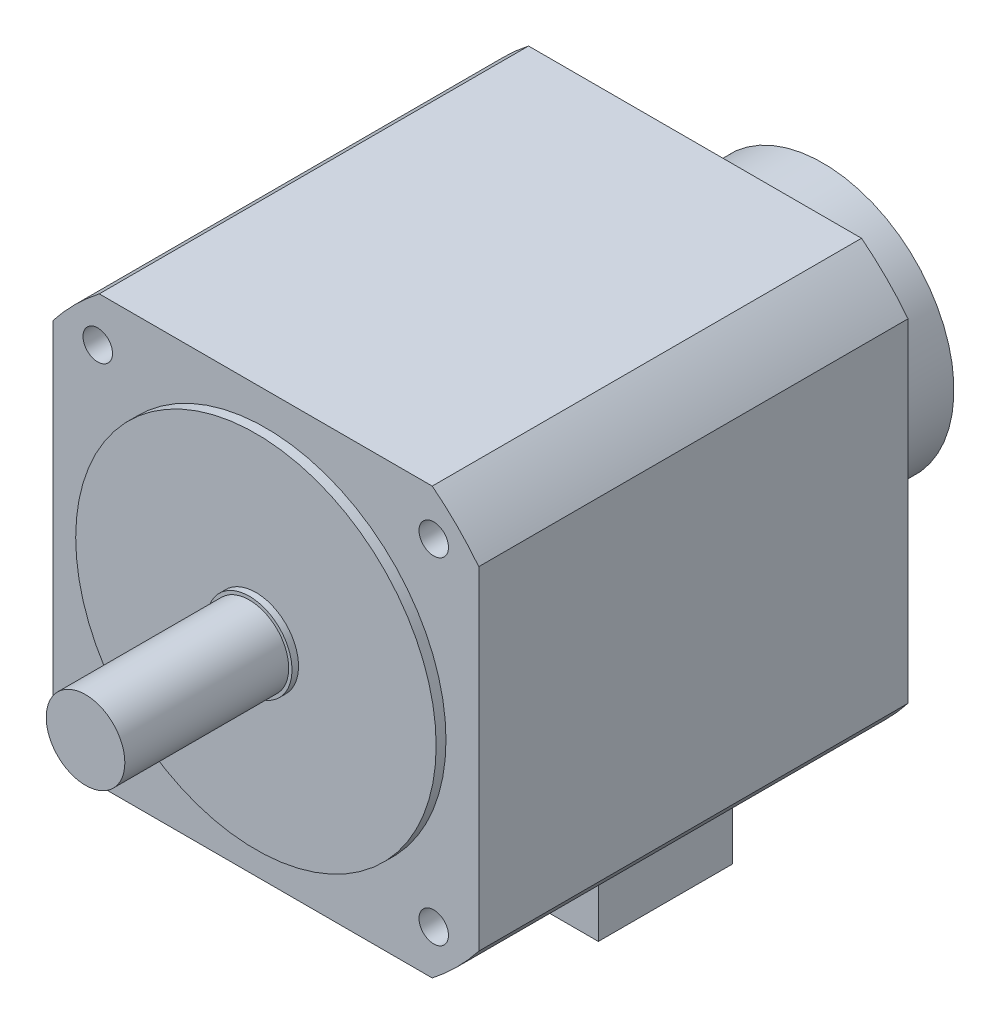
ISO-10303-21;
HEADER;
FILE_DESCRIPTION(('STEP AP214'),'2;1');
FILE_NAME('part.step','',(''),(''),'','','');
FILE_SCHEMA(('AUTOMOTIVE_DESIGN { 1 0 10303 214 1 1 1 1 }'));
ENDSEC;
DATA;
#1=APPLICATION_CONTEXT('core data for automotive mechanical design processes');
#2=APPLICATION_PROTOCOL_DEFINITION('international standard','automotive_design',2000,#1);
#3=PRODUCT_CONTEXT('',#1,'mechanical');
#4=PRODUCT('Part','Part','',(#3));
#5=PRODUCT_RELATED_PRODUCT_CATEGORY('part','',(#4));
#6=PRODUCT_DEFINITION_FORMATION('','',#4);
#7=PRODUCT_DEFINITION_CONTEXT('part definition',#1,'design');
#8=PRODUCT_DEFINITION('design','',#6,#7);
#9=PRODUCT_DEFINITION_SHAPE('','',#8);
#10=(LENGTH_UNIT() NAMED_UNIT(*) SI_UNIT(.MILLI.,.METRE.));
#11=(NAMED_UNIT(*) PLANE_ANGLE_UNIT() SI_UNIT($,.RADIAN.));
#12=(NAMED_UNIT(*) SI_UNIT($,.STERADIAN.) SOLID_ANGLE_UNIT());
#13=UNCERTAINTY_MEASURE_WITH_UNIT(LENGTH_MEASURE(1.E-05),#10,'distance_accuracy_value','');
#14=(GEOMETRIC_REPRESENTATION_CONTEXT(3) GLOBAL_UNCERTAINTY_ASSIGNED_CONTEXT((#13)) GLOBAL_UNIT_ASSIGNED_CONTEXT((#10,
#11,#12)) REPRESENTATION_CONTEXT('',''));
#15=CARTESIAN_POINT('',(0.,0.,0.));
#16=DIRECTION('',(0.,0.,1.));
#17=DIRECTION('',(1.,0.,0.));
#18=AXIS2_PLACEMENT_3D('',#15,#16,#17);
#19=CARTESIAN_POINT('',(50.806003582254,-65.,-186.));
#20=DIRECTION('',(0.,1.,0.));
#21=DIRECTION('',(0.,0.,1.));
#22=AXIS2_PLACEMENT_3D('',#19,#20,#21);
#23=PLANE('',#22);
#24=DIRECTION('',(-1.,0.,0.));
#25=VECTOR('',#24,1.);
#26=CARTESIAN_POINT('',(50.806003582254,-65.,-55.));
#27=LINE('',#26,#25);
#28=CARTESIAN_POINT('',(50.806003582254,-65.,-55.));
#29=VERTEX_POINT('',#28);
#30=CARTESIAN_POINT('',(-50.8060035822539,-65.,-55.));
#31=VERTEX_POINT('',#30);
#32=EDGE_CURVE('E262',#29,#31,#27,.T.);
#33=ORIENTED_EDGE('',*,*,#32,.T.);
#34=DIRECTION('',(0.,0.,1.));
#35=VECTOR('',#34,1.);
#36=CARTESIAN_POINT('',(-50.8060035822539,-65.,-186.));
#37=LINE('',#36,#35);
#38=CARTESIAN_POINT('',(-50.8060035822539,-65.,-186.));
#39=VERTEX_POINT('',#38);
#40=EDGE_CURVE('E282',#39,#31,#37,.T.);
#41=ORIENTED_EDGE('',*,*,#40,.F.);
#42=DIRECTION('',(-1.,0.,0.));
#43=VECTOR('',#42,1.);
#44=CARTESIAN_POINT('',(50.806003582254,-65.,-186.));
#45=LINE('',#44,#43);
#46=CARTESIAN_POINT('',(-19.5,-65.,-186.));
#47=VERTEX_POINT('',#46);
#48=EDGE_CURVE('E243',#47,#39,#45,.T.);
#49=ORIENTED_EDGE('',*,*,#48,.F.);
#50=CARTESIAN_POINT('',(19.5,-65.,-186.));
#51=VERTEX_POINT('',#50);
#52=EDGE_CURVE('E247',#51,#47,#45,.T.);
#53=ORIENTED_EDGE('',*,*,#52,.F.);
#54=CARTESIAN_POINT('',(50.806003582254,-65.,-186.));
#55=VERTEX_POINT('',#54);
#56=EDGE_CURVE('E244',#55,#51,#45,.T.);
#57=ORIENTED_EDGE('',*,*,#56,.F.);
#58=DIRECTION('',(0.,0.,1.));
#59=VECTOR('',#58,1.);
#60=CARTESIAN_POINT('',(50.806003582254,-65.,-186.));
#61=LINE('',#60,#59);
#62=EDGE_CURVE('E285',#55,#29,#61,.T.);
#63=ORIENTED_EDGE('',*,*,#62,.T.);
#64=EDGE_LOOP('',(#33,#41,#49,#53,#57,#63));
#65=FACE_BOUND('',#64,.T.);
#66=DIRECTION('',(0.,0.,1.));
#67=VECTOR('',#66,1.);
#68=CARTESIAN_POINT('',(20.5,-65.,-177.));
#69=LINE('',#68,#67);
#70=CARTESIAN_POINT('',(20.5,-65.,-177.));
#71=VERTEX_POINT('',#70);
#72=CARTESIAN_POINT('',(20.5,-65.,-136.));
#73=VERTEX_POINT('',#72);
#74=EDGE_CURVE('E173',#71,#73,#69,.T.);
#75=ORIENTED_EDGE('',*,*,#74,.F.);
#76=DIRECTION('',(1.,0.,0.));
#77=VECTOR('',#76,1.);
#78=CARTESIAN_POINT('',(-20.5,-65.,-177.));
#79=LINE('',#78,#77);
#80=CARTESIAN_POINT('',(-20.5,-65.,-177.));
#81=VERTEX_POINT('',#80);
#82=EDGE_CURVE('E170',#81,#71,#79,.T.);
#83=ORIENTED_EDGE('',*,*,#82,.F.);
#84=DIRECTION('',(0.,0.,-1.));
#85=VECTOR('',#84,1.);
#86=CARTESIAN_POINT('',(-20.5,-65.,-177.));
#87=LINE('',#86,#85);
#88=CARTESIAN_POINT('',(-20.5,-65.,-136.));
#89=VERTEX_POINT('',#88);
#90=EDGE_CURVE('E54',#89,#81,#87,.T.);
#91=ORIENTED_EDGE('',*,*,#90,.F.);
#92=DIRECTION('',(-1.,0.,0.));
#93=VECTOR('',#92,1.);
#94=CARTESIAN_POINT('',(-20.5,-65.,-136.));
#95=LINE('',#94,#93);
#96=EDGE_CURVE('E49',#73,#89,#95,.T.);
#97=ORIENTED_EDGE('',*,*,#96,.F.);
#98=EDGE_LOOP('',(#75,#83,#91,#97));
#99=FACE_BOUND('',#98,.T.);
#100=ADVANCED_FACE('F32',(#65,#99),#23,.F.);
#101=CARTESIAN_POINT('',(0.,0.,-50.));
#102=DIRECTION('',(0.,0.,1.));
#103=DIRECTION('',(1.,0.,0.));
#104=AXIS2_PLACEMENT_3D('',#101,#102,#103);
#105=CYLINDRICAL_SURFACE('',#104,12.);
#106=CARTESIAN_POINT('',(0.,0.,-50.));
#107=DIRECTION('',(0.,0.,1.));
#108=DIRECTION('',(1.,0.,0.));
#109=AXIS2_PLACEMENT_3D('',#106,#107,#108);
#110=CIRCLE('',#109,12.);
#111=CARTESIAN_POINT('',(12.,0.,-50.));
#112=VERTEX_POINT('',#111);
#113=EDGE_CURVE('E304',#112,#112,#110,.T.);
#114=ORIENTED_EDGE('',*,*,#113,.T.);
#115=EDGE_LOOP('',(#114));
#116=FACE_BOUND('',#115,.T.);
#117=CARTESIAN_POINT('',(0.,0.,0.));
#118=DIRECTION('',(0.,0.,1.));
#119=DIRECTION('',(1.,0.,0.));
#120=AXIS2_PLACEMENT_3D('',#117,#118,#119);
#121=CIRCLE('',#120,12.);
#122=CARTESIAN_POINT('',(12.,0.,0.));
#123=VERTEX_POINT('',#122);
#124=EDGE_CURVE('E36',#123,#123,#121,.T.);
#125=ORIENTED_EDGE('',*,*,#124,.F.);
#126=EDGE_LOOP('',(#125));
#127=FACE_BOUND('',#126,.T.);
#128=ADVANCED_FACE('F34',(#116,#127),#105,.T.);
#129=CARTESIAN_POINT('',(0.,0.,0.));
#130=DIRECTION('',(0.,0.,1.));
#131=DIRECTION('',(1.,0.,0.));
#132=AXIS2_PLACEMENT_3D('',#129,#130,#131);
#133=PLANE('',#132);
#134=ORIENTED_EDGE('',*,*,#124,.T.);
#135=EDGE_LOOP('',(#134));
#136=FACE_BOUND('',#135,.T.);
#137=ADVANCED_FACE('F312',(#136),#133,.T.);
#138=CARTESIAN_POINT('',(0.,0.,-52.));
#139=DIRECTION('',(0.,0.,1.));
#140=DIRECTION('',(1.,0.,0.));
#141=AXIS2_PLACEMENT_3D('',#138,#139,#140);
#142=CYLINDRICAL_SURFACE('',#141,13.);
#143=CARTESIAN_POINT('',(0.,0.,-52.));
#144=DIRECTION('',(0.,0.,-1.));
#145=DIRECTION('',(-1.,0.,0.));
#146=AXIS2_PLACEMENT_3D('',#143,#144,#145);
#147=CIRCLE('',#146,13.);
#148=CARTESIAN_POINT('',(-13.,0.,-52.));
#149=VERTEX_POINT('',#148);
#150=EDGE_CURVE('E301',#149,#149,#147,.T.);
#151=ORIENTED_EDGE('',*,*,#150,.F.);
#152=EDGE_LOOP('',(#151));
#153=FACE_BOUND('',#152,.T.);
#154=CARTESIAN_POINT('',(0.,0.,-50.));
#155=DIRECTION('',(0.,0.,-1.));
#156=DIRECTION('',(-1.,0.,0.));
#157=AXIS2_PLACEMENT_3D('',#154,#155,#156);
#158=CIRCLE('',#157,13.);
#159=CARTESIAN_POINT('',(-13.,0.,-50.));
#160=VERTEX_POINT('',#159);
#161=EDGE_CURVE('E298',#160,#160,#158,.T.);
#162=ORIENTED_EDGE('',*,*,#161,.T.);
#163=EDGE_LOOP('',(#162));
#164=FACE_BOUND('',#163,.T.);
#165=ADVANCED_FACE('F319',(#153,#164),#142,.T.);
#166=CARTESIAN_POINT('',(0.,0.,-50.));
#167=DIRECTION('',(0.,0.,-1.));
#168=DIRECTION('',(-1.,0.,0.));
#169=AXIS2_PLACEMENT_3D('',#166,#167,#168);
#170=PLANE('',#169);
#171=ORIENTED_EDGE('',*,*,#113,.F.);
#172=EDGE_LOOP('',(#171));
#173=FACE_BOUND('',#172,.T.);
#174=ORIENTED_EDGE('',*,*,#161,.F.);
#175=EDGE_LOOP('',(#174));
#176=FACE_BOUND('',#175,.T.);
#177=ADVANCED_FACE('F347',(#173,#176),#170,.F.);
#178=CARTESIAN_POINT('',(0.,0.,-55.));
#179=DIRECTION('',(0.,0.,1.));
#180=DIRECTION('',(1.,0.,0.));
#181=AXIS2_PLACEMENT_3D('',#178,#179,#180);
#182=CYLINDRICAL_SURFACE('',#181,55.);
#183=CARTESIAN_POINT('',(0.,0.,-55.));
#184=DIRECTION('',(0.,0.,-1.));
#185=DIRECTION('',(-1.,0.,0.));
#186=AXIS2_PLACEMENT_3D('',#183,#184,#185);
#187=CIRCLE('',#186,55.);
#188=CARTESIAN_POINT('',(-55.,0.,-55.));
#189=VERTEX_POINT('',#188);
#190=EDGE_CURVE('E295',#189,#189,#187,.T.);
#191=ORIENTED_EDGE('',*,*,#190,.F.);
#192=EDGE_LOOP('',(#191));
#193=FACE_BOUND('',#192,.T.);
#194=CARTESIAN_POINT('',(0.,0.,-52.));
#195=DIRECTION('',(0.,0.,-1.));
#196=DIRECTION('',(-1.,0.,0.));
#197=AXIS2_PLACEMENT_3D('',#194,#195,#196);
#198=CIRCLE('',#197,55.);
#199=CARTESIAN_POINT('',(-55.,0.,-52.));
#200=VERTEX_POINT('',#199);
#201=EDGE_CURVE('E294',#200,#200,#198,.T.);
#202=ORIENTED_EDGE('',*,*,#201,.T.);
#203=EDGE_LOOP('',(#202));
#204=FACE_BOUND('',#203,.T.);
#205=ADVANCED_FACE('F343',(#193,#204),#182,.T.);
#206=CARTESIAN_POINT('',(0.,0.,-52.));
#207=DIRECTION('',(0.,0.,-1.));
#208=DIRECTION('',(-1.,0.,0.));
#209=AXIS2_PLACEMENT_3D('',#206,#207,#208);
#210=PLANE('',#209);
#211=ORIENTED_EDGE('',*,*,#150,.T.);
#212=EDGE_LOOP('',(#211));
#213=FACE_BOUND('',#212,.T.);
#214=ORIENTED_EDGE('',*,*,#201,.F.);
#215=EDGE_LOOP('',(#214));
#216=FACE_BOUND('',#215,.T.);
#217=ADVANCED_FACE('F339',(#213,#216),#210,.F.);
#218=CARTESIAN_POINT('',(0.,0.,-186.));
#219=DIRECTION('',(0.,0.,1.));
#220=DIRECTION('',(1.,0.,0.));
#221=AXIS2_PLACEMENT_3D('',#218,#219,#220);
#222=CYLINDRICAL_SURFACE('',#221,82.5);
#223=CARTESIAN_POINT('',(0.,0.,-55.));
#224=DIRECTION('',(0.,0.,-1.));
#225=DIRECTION('',(-1.,0.,0.));
#226=AXIS2_PLACEMENT_3D('',#223,#224,#225);
#227=CIRCLE('',#226,82.5);
#228=CARTESIAN_POINT('',(50.806003582254,65.,-55.));
#229=VERTEX_POINT('',#228);
#230=CARTESIAN_POINT('',(65.,50.8060035822539,-55.));
#231=VERTEX_POINT('',#230);
#232=EDGE_CURVE('E234',#229,#231,#227,.T.);
#233=ORIENTED_EDGE('',*,*,#232,.T.);
#234=DIRECTION('',(0.,0.,1.));
#235=VECTOR('',#234,1.);
#236=CARTESIAN_POINT('',(65.,50.8060035822539,-186.));
#237=LINE('',#236,#235);
#238=CARTESIAN_POINT('',(65.,50.8060035822539,-186.));
#239=VERTEX_POINT('',#238);
#240=EDGE_CURVE('E291',#239,#231,#237,.T.);
#241=ORIENTED_EDGE('',*,*,#240,.F.);
#242=CARTESIAN_POINT('',(0.,0.,-186.));
#243=DIRECTION('',(0.,0.,-1.));
#244=DIRECTION('',(-1.,0.,0.));
#245=AXIS2_PLACEMENT_3D('',#242,#243,#244);
#246=CIRCLE('',#245,82.5);
#247=CARTESIAN_POINT('',(50.806003582254,65.,-186.));
#248=VERTEX_POINT('',#247);
#249=EDGE_CURVE('E235',#248,#239,#246,.T.);
#250=ORIENTED_EDGE('',*,*,#249,.F.);
#251=DIRECTION('',(0.,0.,1.));
#252=VECTOR('',#251,1.);
#253=CARTESIAN_POINT('',(50.806003582254,65.,-186.));
#254=LINE('',#253,#252);
#255=EDGE_CURVE('E255',#248,#229,#254,.T.);
#256=ORIENTED_EDGE('',*,*,#255,.T.);
#257=EDGE_LOOP('',(#233,#241,#250,#256));
#258=FACE_BOUND('',#257,.T.);
#259=ADVANCED_FACE('F335',(#258),#222,.T.);
#260=CARTESIAN_POINT('',(65.,-50.806003582254,-186.));
#261=DIRECTION('',(-1.,0.,0.));
#262=DIRECTION('',(0.,0.,1.));
#263=AXIS2_PLACEMENT_3D('',#260,#261,#262);
#264=PLANE('',#263);
#265=DIRECTION('',(0.,-1.,0.));
#266=VECTOR('',#265,1.);
#267=CARTESIAN_POINT('',(65.,-50.806003582254,-55.));
#268=LINE('',#267,#266);
#269=CARTESIAN_POINT('',(65.,-50.806003582254,-55.));
#270=VERTEX_POINT('',#269);
#271=EDGE_CURVE('E258',#231,#270,#268,.T.);
#272=ORIENTED_EDGE('',*,*,#271,.T.);
#273=DIRECTION('',(0.,0.,1.));
#274=VECTOR('',#273,1.);
#275=CARTESIAN_POINT('',(65.,-50.806003582254,-186.));
#276=LINE('',#275,#274);
#277=CARTESIAN_POINT('',(65.,-50.806003582254,-186.));
#278=VERTEX_POINT('',#277);
#279=EDGE_CURVE('E288',#278,#270,#276,.T.);
#280=ORIENTED_EDGE('',*,*,#279,.F.);
#281=DIRECTION('',(0.,-1.,0.));
#282=VECTOR('',#281,1.);
#283=CARTESIAN_POINT('',(65.,-50.806003582254,-186.));
#284=LINE('',#283,#282);
#285=EDGE_CURVE('E238',#239,#278,#284,.T.);
#286=ORIENTED_EDGE('',*,*,#285,.F.);
#287=ORIENTED_EDGE('',*,*,#240,.T.);
#288=EDGE_LOOP('',(#272,#280,#286,#287));
#289=FACE_BOUND('',#288,.T.);
#290=ADVANCED_FACE('F331',(#289),#264,.F.);
#291=CARTESIAN_POINT('',(0.,0.,-186.));
#292=DIRECTION('',(0.,0.,1.));
#293=DIRECTION('',(1.,0.,0.));
#294=AXIS2_PLACEMENT_3D('',#291,#292,#293);
#295=CYLINDRICAL_SURFACE('',#294,82.5);
#296=CARTESIAN_POINT('',(0.,0.,-55.));
#297=DIRECTION('',(0.,0.,-1.));
#298=DIRECTION('',(-1.,0.,0.));
#299=AXIS2_PLACEMENT_3D('',#296,#297,#298);
#300=CIRCLE('',#299,82.5);
#301=EDGE_CURVE('E260',#270,#29,#300,.T.);
#302=ORIENTED_EDGE('',*,*,#301,.T.);
#303=ORIENTED_EDGE('',*,*,#62,.F.);
#304=CARTESIAN_POINT('',(0.,0.,-186.));
#305=DIRECTION('',(0.,0.,-1.));
#306=DIRECTION('',(-1.,0.,0.));
#307=AXIS2_PLACEMENT_3D('',#304,#305,#306);
#308=CIRCLE('',#307,82.5);
#309=EDGE_CURVE('E241',#278,#55,#308,.T.);
#310=ORIENTED_EDGE('',*,*,#309,.F.);
#311=ORIENTED_EDGE('',*,*,#279,.T.);
#312=EDGE_LOOP('',(#302,#303,#310,#311));
#313=FACE_BOUND('',#312,.T.);
#314=ADVANCED_FACE('F328',(#313),#295,.T.);
#315=CARTESIAN_POINT('',(0.,0.,-186.));
#316=DIRECTION('',(0.,0.,1.));
#317=DIRECTION('',(1.,0.,0.));
#318=AXIS2_PLACEMENT_3D('',#315,#316,#317);
#319=CYLINDRICAL_SURFACE('',#318,82.5);
#320=CARTESIAN_POINT('',(0.,0.,-55.));
#321=DIRECTION('',(0.,0.,-1.));
#322=DIRECTION('',(-1.,0.,0.));
#323=AXIS2_PLACEMENT_3D('',#320,#321,#322);
#324=CIRCLE('',#323,82.5);
#325=CARTESIAN_POINT('',(-65.,-50.8060035822539,-55.));
#326=VERTEX_POINT('',#325);
#327=EDGE_CURVE('E264',#31,#326,#324,.T.);
#328=ORIENTED_EDGE('',*,*,#327,.T.);
#329=DIRECTION('',(0.,0.,1.));
#330=VECTOR('',#329,1.);
#331=CARTESIAN_POINT('',(-65.,-50.8060035822539,-186.));
#332=LINE('',#331,#330);
#333=CARTESIAN_POINT('',(-65.,-50.8060035822539,-186.));
#334=VERTEX_POINT('',#333);
#335=EDGE_CURVE('E279',#334,#326,#332,.T.);
#336=ORIENTED_EDGE('',*,*,#335,.F.);
#337=CARTESIAN_POINT('',(0.,0.,-186.));
#338=DIRECTION('',(0.,0.,-1.));
#339=DIRECTION('',(-1.,0.,0.));
#340=AXIS2_PLACEMENT_3D('',#337,#338,#339);
#341=CIRCLE('',#340,82.5);
#342=EDGE_CURVE('E246',#39,#334,#341,.T.);
#343=ORIENTED_EDGE('',*,*,#342,.F.);
#344=ORIENTED_EDGE('',*,*,#40,.T.);
#345=EDGE_LOOP('',(#328,#336,#343,#344));
#346=FACE_BOUND('',#345,.T.);
#347=ADVANCED_FACE('F326',(#346),#319,.T.);
#348=CARTESIAN_POINT('',(-65.,-50.8060035822539,-186.));
#349=DIRECTION('',(1.,0.,0.));
#350=DIRECTION('',(0.,0.,-1.));
#351=AXIS2_PLACEMENT_3D('',#348,#349,#350);
#352=PLANE('',#351);
#353=DIRECTION('',(0.,1.,0.));
#354=VECTOR('',#353,1.);
#355=CARTESIAN_POINT('',(-65.,-50.8060035822539,-55.));
#356=LINE('',#355,#354);
#357=CARTESIAN_POINT('',(-65.,50.8060035822539,-55.));
#358=VERTEX_POINT('',#357);
#359=EDGE_CURVE('E266',#326,#358,#356,.T.);
#360=ORIENTED_EDGE('',*,*,#359,.T.);
#361=DIRECTION('',(0.,0.,1.));
#362=VECTOR('',#361,1.);
#363=CARTESIAN_POINT('',(-65.,50.8060035822539,-186.));
#364=LINE('',#363,#362);
#365=CARTESIAN_POINT('',(-65.,50.8060035822539,-186.));
#366=VERTEX_POINT('',#365);
#367=EDGE_CURVE('E276',#366,#358,#364,.T.);
#368=ORIENTED_EDGE('',*,*,#367,.F.);
#369=DIRECTION('',(0.,1.,0.));
#370=VECTOR('',#369,1.);
#371=CARTESIAN_POINT('',(-65.,-50.8060035822539,-186.));
#372=LINE('',#371,#370);
#373=EDGE_CURVE('E249',#334,#366,#372,.T.);
#374=ORIENTED_EDGE('',*,*,#373,.F.);
#375=ORIENTED_EDGE('',*,*,#335,.T.);
#376=EDGE_LOOP('',(#360,#368,#374,#375));
#377=FACE_BOUND('',#376,.T.);
#378=ADVANCED_FACE('F395',(#377),#352,.F.);
#379=CARTESIAN_POINT('',(0.,0.,-186.));
#380=DIRECTION('',(0.,0.,1.));
#381=DIRECTION('',(1.,0.,0.));
#382=AXIS2_PLACEMENT_3D('',#379,#380,#381);
#383=CYLINDRICAL_SURFACE('',#382,82.5);
#384=CARTESIAN_POINT('',(0.,0.,-55.));
#385=DIRECTION('',(0.,0.,-1.));
#386=DIRECTION('',(-1.,0.,0.));
#387=AXIS2_PLACEMENT_3D('',#384,#385,#386);
#388=CIRCLE('',#387,82.5);
#389=CARTESIAN_POINT('',(-50.8060035822539,65.,-55.));
#390=VERTEX_POINT('',#389);
#391=EDGE_CURVE('E268',#358,#390,#388,.T.);
#392=ORIENTED_EDGE('',*,*,#391,.T.);
#393=DIRECTION('',(0.,0.,1.));
#394=VECTOR('',#393,1.);
#395=CARTESIAN_POINT('',(-50.8060035822539,65.,-186.));
#396=LINE('',#395,#394);
#397=CARTESIAN_POINT('',(-50.8060035822539,65.,-186.));
#398=VERTEX_POINT('',#397);
#399=EDGE_CURVE('E273',#398,#390,#396,.T.);
#400=ORIENTED_EDGE('',*,*,#399,.F.);
#401=CARTESIAN_POINT('',(0.,0.,-186.));
#402=DIRECTION('',(0.,0.,-1.));
#403=DIRECTION('',(-1.,0.,0.));
#404=AXIS2_PLACEMENT_3D('',#401,#402,#403);
#405=CIRCLE('',#404,82.5);
#406=EDGE_CURVE('E251',#366,#398,#405,.T.);
#407=ORIENTED_EDGE('',*,*,#406,.F.);
#408=ORIENTED_EDGE('',*,*,#367,.T.);
#409=EDGE_LOOP('',(#392,#400,#407,#408));
#410=FACE_BOUND('',#409,.T.);
#411=ADVANCED_FACE('F402',(#410),#383,.T.);
#412=CARTESIAN_POINT('',(50.806003582254,65.,-186.));
#413=DIRECTION('',(0.,-1.,0.));
#414=DIRECTION('',(0.,0.,-1.));
#415=AXIS2_PLACEMENT_3D('',#412,#413,#414);
#416=PLANE('',#415);
#417=DIRECTION('',(1.,0.,0.));
#418=VECTOR('',#417,1.);
#419=CARTESIAN_POINT('',(50.806003582254,65.,-55.));
#420=LINE('',#419,#418);
#421=EDGE_CURVE('E239',#390,#229,#420,.T.);
#422=ORIENTED_EDGE('',*,*,#421,.T.);
#423=ORIENTED_EDGE('',*,*,#255,.F.);
#424=DIRECTION('',(1.,0.,0.));
#425=VECTOR('',#424,1.);
#426=CARTESIAN_POINT('',(50.806003582254,65.,-186.));
#427=LINE('',#426,#425);
#428=EDGE_CURVE('E253',#398,#248,#427,.T.);
#429=ORIENTED_EDGE('',*,*,#428,.F.);
#430=ORIENTED_EDGE('',*,*,#399,.T.);
#431=EDGE_LOOP('',(#422,#423,#429,#430));
#432=FACE_BOUND('',#431,.T.);
#433=ADVANCED_FACE('F409',(#432),#416,.F.);
#434=CARTESIAN_POINT('',(0.,0.,-186.));
#435=DIRECTION('',(0.,0.,-1.));
#436=DIRECTION('',(-1.,0.,0.));
#437=AXIS2_PLACEMENT_3D('',#434,#435,#436);
#438=PLANE('',#437);
#439=DIRECTION('',(0.,1.,0.));
#440=VECTOR('',#439,1.);
#441=CARTESIAN_POINT('',(-19.5,-34.9249194702006,-186.));
#442=LINE('',#441,#440);
#443=CARTESIAN_POINT('',(-19.5,-34.9249194702006,-186.));
#444=VERTEX_POINT('',#443);
#445=EDGE_CURVE('E11',#47,#444,#442,.T.);
#446=ORIENTED_EDGE('',*,*,#445,.F.);
#447=ORIENTED_EDGE('',*,*,#48,.T.);
#448=ORIENTED_EDGE('',*,*,#342,.T.);
#449=ORIENTED_EDGE('',*,*,#373,.T.);
#450=ORIENTED_EDGE('',*,*,#406,.T.);
#451=ORIENTED_EDGE('',*,*,#428,.T.);
#452=ORIENTED_EDGE('',*,*,#249,.T.);
#453=ORIENTED_EDGE('',*,*,#285,.T.);
#454=ORIENTED_EDGE('',*,*,#309,.T.);
#455=ORIENTED_EDGE('',*,*,#56,.T.);
#456=DIRECTION('',(0.,-1.,0.));
#457=VECTOR('',#456,1.);
#458=CARTESIAN_POINT('',(19.5,-34.9249194702006,-186.));
#459=LINE('',#458,#457);
#460=CARTESIAN_POINT('',(19.5,-34.9249194702006,-186.));
#461=VERTEX_POINT('',#460);
#462=EDGE_CURVE('E217',#461,#51,#459,.T.);
#463=ORIENTED_EDGE('',*,*,#462,.F.);
#464=CARTESIAN_POINT('',(0.,0.,-186.));
#465=DIRECTION('',(0.,0.,-1.));
#466=DIRECTION('',(-1.,0.,0.));
#467=AXIS2_PLACEMENT_3D('',#464,#465,#466);
#468=CIRCLE('',#467,40.);
#469=EDGE_CURVE('E201',#444,#461,#468,.T.);
#470=ORIENTED_EDGE('',*,*,#469,.F.);
#471=EDGE_LOOP('',(#446,#447,#448,#449,#450,#451,#452,#453,#454,#455,#463,#470));
#472=FACE_BOUND('',#471,.T.);
#473=ADVANCED_FACE('F417',(#472),#438,.T.);
#474=CARTESIAN_POINT('',(0.,0.,-55.));
#475=DIRECTION('',(0.,0.,-1.));
#476=DIRECTION('',(-1.,0.,0.));
#477=AXIS2_PLACEMENT_3D('',#474,#475,#476);
#478=PLANE('',#477);
#479=CARTESIAN_POINT('',(-51.2652416360218,-51.2652416360247,-55.));
#480=DIRECTION('',(0.,0.,1.));
#481=DIRECTION('',(1.,0.,0.));
#482=AXIS2_PLACEMENT_3D('',#479,#480,#481);
#483=CIRCLE('',#482,4.50000000000151);
#484=CARTESIAN_POINT('',(-46.7652416360203,-51.2652416360247,-55.));
#485=VERTEX_POINT('',#484);
#486=EDGE_CURVE('E174',#485,#485,#483,.T.);
#487=ORIENTED_EDGE('',*,*,#486,.F.);
#488=EDGE_LOOP('',(#487));
#489=FACE_BOUND('',#488,.T.);
#490=CARTESIAN_POINT('',(51.2652416360276,-51.2652416360218,-55.));
#491=DIRECTION('',(0.,0.,1.));
#492=DIRECTION('',(1.,0.,0.));
#493=AXIS2_PLACEMENT_3D('',#490,#491,#492);
#494=CIRCLE('',#493,4.50000000000402);
#495=CARTESIAN_POINT('',(55.7652416360316,-51.2652416360218,-55.));
#496=VERTEX_POINT('',#495);
#497=EDGE_CURVE('E193',#496,#496,#494,.T.);
#498=ORIENTED_EDGE('',*,*,#497,.F.);
#499=EDGE_LOOP('',(#498));
#500=FACE_BOUND('',#499,.T.);
#501=CARTESIAN_POINT('',(51.2652416360247,51.2652416360276,-55.));
#502=DIRECTION('',(0.,0.,1.));
#503=DIRECTION('',(1.,0.,0.));
#504=AXIS2_PLACEMENT_3D('',#501,#502,#503);
#505=CIRCLE('',#504,4.50000000000294);
#506=CARTESIAN_POINT('',(55.7652416360276,51.2652416360276,-55.));
#507=VERTEX_POINT('',#506);
#508=EDGE_CURVE('E187',#507,#507,#505,.T.);
#509=ORIENTED_EDGE('',*,*,#508,.F.);
#510=EDGE_LOOP('',(#509));
#511=FACE_BOUND('',#510,.T.);
#512=CARTESIAN_POINT('',(-51.2652416360247,51.2652416360247,-55.));
#513=DIRECTION('',(0.,0.,1.));
#514=DIRECTION('',(1.,0.,0.));
#515=AXIS2_PLACEMENT_3D('',#512,#513,#514);
#516=CIRCLE('',#515,4.5);
#517=CARTESIAN_POINT('',(-46.7652416360247,51.2652416360247,-55.));
#518=VERTEX_POINT('',#517);
#519=EDGE_CURVE('E186',#518,#518,#516,.T.);
#520=ORIENTED_EDGE('',*,*,#519,.F.);
#521=EDGE_LOOP('',(#520));
#522=FACE_BOUND('',#521,.T.);
#523=ORIENTED_EDGE('',*,*,#190,.T.);
#524=EDGE_LOOP('',(#523));
#525=FACE_BOUND('',#524,.T.);
#526=ORIENTED_EDGE('',*,*,#232,.F.);
#527=ORIENTED_EDGE('',*,*,#421,.F.);
#528=ORIENTED_EDGE('',*,*,#391,.F.);
#529=ORIENTED_EDGE('',*,*,#359,.F.);
#530=ORIENTED_EDGE('',*,*,#327,.F.);
#531=ORIENTED_EDGE('',*,*,#32,.F.);
#532=ORIENTED_EDGE('',*,*,#301,.F.);
#533=ORIENTED_EDGE('',*,*,#271,.F.);
#534=EDGE_LOOP('',(#526,#527,#528,#529,#530,#531,#532,#533));
#535=FACE_BOUND('',#534,.T.);
#536=ADVANCED_FACE('F425',(#489,#500,#511,#522,#525,#535),#478,.F.);
#537=CARTESIAN_POINT('',(0.,0.,-186.));
#538=DIRECTION('',(0.,0.,-1.));
#539=DIRECTION('',(-1.,0.,0.));
#540=AXIS2_PLACEMENT_3D('',#537,#538,#539);
#541=PLANE('',#540);
#542=CARTESIAN_POINT('',(19.5,-81.5,-186.));
#543=VERTEX_POINT('',#542);
#544=EDGE_CURVE('E216',#51,#543,#459,.T.);
#545=ORIENTED_EDGE('',*,*,#544,.F.);
#546=ORIENTED_EDGE('',*,*,#52,.T.);
#547=CARTESIAN_POINT('',(-19.5,-81.5,-186.));
#548=VERTEX_POINT('',#547);
#549=EDGE_CURVE('E42',#548,#47,#442,.T.);
#550=ORIENTED_EDGE('',*,*,#549,.F.);
#551=DIRECTION('',(-1.,0.,0.));
#552=VECTOR('',#551,1.);
#553=CARTESIAN_POINT('',(19.5,-81.5,-186.));
#554=LINE('',#553,#552);
#555=EDGE_CURVE('E220',#543,#548,#554,.T.);
#556=ORIENTED_EDGE('',*,*,#555,.F.);
#557=EDGE_LOOP('',(#545,#546,#550,#556));
#558=FACE_BOUND('',#557,.T.);
#559=ADVANCED_FACE('F434',(#558),#541,.F.);
#560=CARTESIAN_POINT('',(0.,0.,-225.));
#561=DIRECTION('',(0.,0.,1.));
#562=DIRECTION('',(1.,0.,0.));
#563=AXIS2_PLACEMENT_3D('',#560,#561,#562);
#564=CYLINDRICAL_SURFACE('',#563,40.);
#565=ORIENTED_EDGE('',*,*,#469,.T.);
#566=DIRECTION('',(0.,0.,1.));
#567=VECTOR('',#566,1.);
#568=CARTESIAN_POINT('',(19.5,-34.9249194702006,-225.));
#569=LINE('',#568,#567);
#570=CARTESIAN_POINT('',(19.5,-34.9249194702006,-225.));
#571=VERTEX_POINT('',#570);
#572=EDGE_CURVE('E231',#571,#461,#569,.T.);
#573=ORIENTED_EDGE('',*,*,#572,.F.);
#574=CARTESIAN_POINT('',(0.,0.,-225.));
#575=DIRECTION('',(0.,0.,-1.));
#576=DIRECTION('',(-1.,0.,0.));
#577=AXIS2_PLACEMENT_3D('',#574,#575,#576);
#578=CIRCLE('',#577,40.);
#579=CARTESIAN_POINT('',(-19.5,-34.9249194702006,-225.));
#580=VERTEX_POINT('',#579);
#581=EDGE_CURVE('E204',#580,#571,#578,.T.);
#582=ORIENTED_EDGE('',*,*,#581,.F.);
#583=DIRECTION('',(0.,0.,1.));
#584=VECTOR('',#583,1.);
#585=CARTESIAN_POINT('',(-19.5,-34.9249194702006,-225.));
#586=LINE('',#585,#584);
#587=EDGE_CURVE('E213',#580,#444,#586,.T.);
#588=ORIENTED_EDGE('',*,*,#587,.T.);
#589=EDGE_LOOP('',(#565,#573,#582,#588));
#590=FACE_BOUND('',#589,.T.);
#591=ADVANCED_FACE('F443',(#590),#564,.T.);
#592=CARTESIAN_POINT('',(19.5,-34.9249194702006,-225.));
#593=DIRECTION('',(-1.,0.,0.));
#594=DIRECTION('',(0.,-1.,0.));
#595=AXIS2_PLACEMENT_3D('',#592,#593,#594);
#596=PLANE('',#595);
#597=ORIENTED_EDGE('',*,*,#462,.T.);
#598=ORIENTED_EDGE('',*,*,#544,.T.);
#599=DIRECTION('',(0.,0.,1.));
#600=VECTOR('',#599,1.);
#601=CARTESIAN_POINT('',(19.5,-81.5,-225.));
#602=LINE('',#601,#600);
#603=CARTESIAN_POINT('',(19.5,-81.5,-225.));
#604=VERTEX_POINT('',#603);
#605=EDGE_CURVE('E228',#604,#543,#602,.T.);
#606=ORIENTED_EDGE('',*,*,#605,.F.);
#607=DIRECTION('',(0.,-1.,0.));
#608=VECTOR('',#607,1.);
#609=CARTESIAN_POINT('',(19.5,-34.9249194702006,-225.));
#610=LINE('',#609,#608);
#611=EDGE_CURVE('E207',#571,#604,#610,.T.);
#612=ORIENTED_EDGE('',*,*,#611,.F.);
#613=ORIENTED_EDGE('',*,*,#572,.T.);
#614=EDGE_LOOP('',(#597,#598,#606,#612,#613));
#615=FACE_BOUND('',#614,.T.);
#616=ADVANCED_FACE('F451',(#615),#596,.F.);
#617=CARTESIAN_POINT('',(19.5,-81.5,-225.));
#618=DIRECTION('',(0.,1.,0.));
#619=DIRECTION('',(0.,0.,1.));
#620=AXIS2_PLACEMENT_3D('',#617,#618,#619);
#621=PLANE('',#620);
#622=ORIENTED_EDGE('',*,*,#555,.T.);
#623=DIRECTION('',(0.,0.,1.));
#624=VECTOR('',#623,1.);
#625=CARTESIAN_POINT('',(-19.5,-81.5,-225.));
#626=LINE('',#625,#624);
#627=CARTESIAN_POINT('',(-19.5,-81.5,-225.));
#628=VERTEX_POINT('',#627);
#629=EDGE_CURVE('E225',#628,#548,#626,.T.);
#630=ORIENTED_EDGE('',*,*,#629,.F.);
#631=DIRECTION('',(-1.,0.,0.));
#632=VECTOR('',#631,1.);
#633=CARTESIAN_POINT('',(19.5,-81.5,-225.));
#634=LINE('',#633,#632);
#635=EDGE_CURVE('E209',#604,#628,#634,.T.);
#636=ORIENTED_EDGE('',*,*,#635,.F.);
#637=ORIENTED_EDGE('',*,*,#605,.T.);
#638=EDGE_LOOP('',(#622,#630,#636,#637));
#639=FACE_BOUND('',#638,.T.);
#640=ADVANCED_FACE('F459',(#639),#621,.F.);
#641=CARTESIAN_POINT('',(-19.5,-34.9249194702006,-225.));
#642=DIRECTION('',(1.,0.,0.));
#643=DIRECTION('',(0.,1.,0.));
#644=AXIS2_PLACEMENT_3D('',#641,#642,#643);
#645=PLANE('',#644);
#646=ORIENTED_EDGE('',*,*,#549,.T.);
#647=ORIENTED_EDGE('',*,*,#445,.T.);
#648=ORIENTED_EDGE('',*,*,#587,.F.);
#649=DIRECTION('',(0.,1.,0.));
#650=VECTOR('',#649,1.);
#651=CARTESIAN_POINT('',(-19.5,-34.9249194702006,-225.));
#652=LINE('',#651,#650);
#653=EDGE_CURVE('E211',#628,#580,#652,.T.);
#654=ORIENTED_EDGE('',*,*,#653,.F.);
#655=ORIENTED_EDGE('',*,*,#629,.T.);
#656=EDGE_LOOP('',(#646,#647,#648,#654,#655));
#657=FACE_BOUND('',#656,.T.);
#658=ADVANCED_FACE('F467',(#657),#645,.F.);
#659=CARTESIAN_POINT('',(0.,0.,-225.));
#660=DIRECTION('',(0.,0.,-1.));
#661=DIRECTION('',(-1.,0.,0.));
#662=AXIS2_PLACEMENT_3D('',#659,#660,#661);
#663=PLANE('',#662);
#664=ORIENTED_EDGE('',*,*,#581,.T.);
#665=ORIENTED_EDGE('',*,*,#611,.T.);
#666=ORIENTED_EDGE('',*,*,#635,.T.);
#667=ORIENTED_EDGE('',*,*,#653,.T.);
#668=EDGE_LOOP('',(#664,#665,#666,#667));
#669=FACE_BOUND('',#668,.T.);
#670=ADVANCED_FACE('F475',(#669),#663,.T.);
#671=CARTESIAN_POINT('',(-51.2652416360247,51.2652416360247,-70.));
#672=DIRECTION('',(0.,0.,1.));
#673=DIRECTION('',(1.,0.,0.));
#674=AXIS2_PLACEMENT_3D('',#671,#672,#673);
#675=CYLINDRICAL_SURFACE('',#674,4.5);
#676=CARTESIAN_POINT('',(-51.2652416360247,51.2652416360247,-70.));
#677=DIRECTION('',(0.,0.,1.));
#678=DIRECTION('',(1.,0.,0.));
#679=AXIS2_PLACEMENT_3D('',#676,#677,#678);
#680=CIRCLE('',#679,4.5);
#681=CARTESIAN_POINT('',(-46.7652416360247,51.2652416360247,-70.));
#682=VERTEX_POINT('',#681);
#683=EDGE_CURVE('E198',#682,#682,#680,.T.);
#684=ORIENTED_EDGE('',*,*,#683,.F.);
#685=EDGE_LOOP('',(#684));
#686=FACE_BOUND('',#685,.T.);
#687=ORIENTED_EDGE('',*,*,#519,.T.);
#688=EDGE_LOOP('',(#687));
#689=FACE_BOUND('',#688,.T.);
#690=ADVANCED_FACE('F482',(#686,#689),#675,.F.);
#691=CARTESIAN_POINT('',(-51.2652416360247,51.2652416360247,-70.));
#692=DIRECTION('',(0.,0.,1.));
#693=DIRECTION('',(1.,0.,0.));
#694=AXIS2_PLACEMENT_3D('',#691,#692,#693);
#695=PLANE('',#694);
#696=ORIENTED_EDGE('',*,*,#683,.T.);
#697=EDGE_LOOP('',(#696));
#698=FACE_BOUND('',#697,.T.);
#699=ADVANCED_FACE('F489',(#698),#695,.T.);
#700=CARTESIAN_POINT('',(51.2652416360247,51.2652416360276,-70.));
#701=DIRECTION('',(0.,0.,1.));
#702=DIRECTION('',(1.,0.,0.));
#703=AXIS2_PLACEMENT_3D('',#700,#701,#702);
#704=CYLINDRICAL_SURFACE('',#703,4.50000000000294);
#705=CARTESIAN_POINT('',(51.2652416360247,51.2652416360276,-70.));
#706=DIRECTION('',(0.,0.,1.));
#707=DIRECTION('',(1.,0.,0.));
#708=AXIS2_PLACEMENT_3D('',#705,#706,#707);
#709=CIRCLE('',#708,4.50000000000294);
#710=CARTESIAN_POINT('',(55.7652416360276,51.2652416360276,-70.));
#711=VERTEX_POINT('',#710);
#712=EDGE_CURVE('E183',#711,#711,#709,.T.);
#713=ORIENTED_EDGE('',*,*,#712,.F.);
#714=EDGE_LOOP('',(#713));
#715=FACE_BOUND('',#714,.T.);
#716=ORIENTED_EDGE('',*,*,#508,.T.);
#717=EDGE_LOOP('',(#716));
#718=FACE_BOUND('',#717,.T.);
#719=ADVANCED_FACE('F497',(#715,#718),#704,.F.);
#720=CARTESIAN_POINT('',(51.2652416360247,51.2652416360276,-70.));
#721=DIRECTION('',(0.,0.,1.));
#722=DIRECTION('',(1.,0.,0.));
#723=AXIS2_PLACEMENT_3D('',#720,#721,#722);
#724=PLANE('',#723);
#725=ORIENTED_EDGE('',*,*,#712,.T.);
#726=EDGE_LOOP('',(#725));
#727=FACE_BOUND('',#726,.T.);
#728=ADVANCED_FACE('F505',(#727),#724,.T.);
#729=CARTESIAN_POINT('',(51.2652416360276,-51.2652416360218,-70.));
#730=DIRECTION('',(0.,0.,1.));
#731=DIRECTION('',(1.,0.,0.));
#732=AXIS2_PLACEMENT_3D('',#729,#730,#731);
#733=CYLINDRICAL_SURFACE('',#732,4.50000000000402);
#734=CARTESIAN_POINT('',(51.2652416360276,-51.2652416360218,-70.));
#735=DIRECTION('',(0.,0.,1.));
#736=DIRECTION('',(1.,0.,0.));
#737=AXIS2_PLACEMENT_3D('',#734,#735,#736);
#738=CIRCLE('',#737,4.50000000000402);
#739=CARTESIAN_POINT('',(55.7652416360316,-51.2652416360218,-70.));
#740=VERTEX_POINT('',#739);
#741=EDGE_CURVE('E190',#740,#740,#738,.T.);
#742=ORIENTED_EDGE('',*,*,#741,.F.);
#743=EDGE_LOOP('',(#742));
#744=FACE_BOUND('',#743,.T.);
#745=ORIENTED_EDGE('',*,*,#497,.T.);
#746=EDGE_LOOP('',(#745));
#747=FACE_BOUND('',#746,.T.);
#748=ADVANCED_FACE('F513',(#744,#747),#733,.F.);
#749=CARTESIAN_POINT('',(51.2652416360276,-51.2652416360218,-70.));
#750=DIRECTION('',(0.,0.,1.));
#751=DIRECTION('',(1.,0.,0.));
#752=AXIS2_PLACEMENT_3D('',#749,#750,#751);
#753=PLANE('',#752);
#754=ORIENTED_EDGE('',*,*,#741,.T.);
#755=EDGE_LOOP('',(#754));
#756=FACE_BOUND('',#755,.T.);
#757=ADVANCED_FACE('F521',(#756),#753,.T.);
#758=CARTESIAN_POINT('',(-51.2652416360218,-51.2652416360247,-70.));
#759=DIRECTION('',(0.,0.,1.));
#760=DIRECTION('',(1.,0.,0.));
#761=AXIS2_PLACEMENT_3D('',#758,#759,#760);
#762=CYLINDRICAL_SURFACE('',#761,4.50000000000151);
#763=CARTESIAN_POINT('',(-51.2652416360218,-51.2652416360247,-70.));
#764=DIRECTION('',(0.,0.,1.));
#765=DIRECTION('',(1.,0.,0.));
#766=AXIS2_PLACEMENT_3D('',#763,#764,#765);
#767=CIRCLE('',#766,4.50000000000151);
#768=CARTESIAN_POINT('',(-46.7652416360203,-51.2652416360247,-70.));
#769=VERTEX_POINT('',#768);
#770=EDGE_CURVE('E177',#769,#769,#767,.T.);
#771=ORIENTED_EDGE('',*,*,#770,.F.);
#772=EDGE_LOOP('',(#771));
#773=FACE_BOUND('',#772,.T.);
#774=ORIENTED_EDGE('',*,*,#486,.T.);
#775=EDGE_LOOP('',(#774));
#776=FACE_BOUND('',#775,.T.);
#777=ADVANCED_FACE('F529',(#773,#776),#762,.F.);
#778=CARTESIAN_POINT('',(-51.2652416360218,-51.2652416360247,-70.));
#779=DIRECTION('',(0.,0.,1.));
#780=DIRECTION('',(1.,0.,0.));
#781=AXIS2_PLACEMENT_3D('',#778,#779,#780);
#782=PLANE('',#781);
#783=ORIENTED_EDGE('',*,*,#770,.T.);
#784=EDGE_LOOP('',(#783));
#785=FACE_BOUND('',#784,.T.);
#786=ADVANCED_FACE('F537',(#785),#782,.T.);
#787=CARTESIAN_POINT('',(20.5,-111.,-177.));
#788=DIRECTION('',(-1.,0.,0.));
#789=DIRECTION('',(0.,0.,1.));
#790=AXIS2_PLACEMENT_3D('',#787,#788,#789);
#791=PLANE('',#790);
#792=ORIENTED_EDGE('',*,*,#74,.T.);
#793=DIRECTION('',(0.,1.,0.));
#794=VECTOR('',#793,1.);
#795=CARTESIAN_POINT('',(20.5,-111.,-136.));
#796=LINE('',#795,#794);
#797=CARTESIAN_POINT('',(20.5,-111.,-136.));
#798=VERTEX_POINT('',#797);
#799=EDGE_CURVE('E154',#798,#73,#796,.T.);
#800=ORIENTED_EDGE('',*,*,#799,.F.);
#801=DIRECTION('',(0.,0.,1.));
#802=VECTOR('',#801,1.);
#803=CARTESIAN_POINT('',(20.5,-111.,-177.));
#804=LINE('',#803,#802);
#805=CARTESIAN_POINT('',(20.5,-111.,-177.));
#806=VERTEX_POINT('',#805);
#807=EDGE_CURVE('E161',#806,#798,#804,.T.);
#808=ORIENTED_EDGE('',*,*,#807,.F.);
#809=DIRECTION('',(0.,1.,0.));
#810=VECTOR('',#809,1.);
#811=CARTESIAN_POINT('',(20.5,-111.,-177.));
#812=LINE('',#811,#810);
#813=EDGE_CURVE('E660',#806,#71,#812,.T.);
#814=ORIENTED_EDGE('',*,*,#813,.T.);
#815=EDGE_LOOP('',(#792,#800,#808,#814));
#816=FACE_BOUND('',#815,.T.);
#817=ADVANCED_FACE('F172',(#816),#791,.F.);
#818=CARTESIAN_POINT('',(-20.5,-111.,-136.));
#819=DIRECTION('',(0.,0.,-1.));
#820=DIRECTION('',(-1.,0.,0.));
#821=AXIS2_PLACEMENT_3D('',#818,#819,#820);
#822=PLANE('',#821);
#823=ORIENTED_EDGE('',*,*,#96,.T.);
#824=DIRECTION('',(0.,1.,0.));
#825=VECTOR('',#824,1.);
#826=CARTESIAN_POINT('',(-20.5,-111.,-136.));
#827=LINE('',#826,#825);
#828=CARTESIAN_POINT('',(-20.5,-111.,-136.));
#829=VERTEX_POINT('',#828);
#830=EDGE_CURVE('E157',#829,#89,#827,.T.);
#831=ORIENTED_EDGE('',*,*,#830,.F.);
#832=DIRECTION('',(-1.,0.,0.));
#833=VECTOR('',#832,1.);
#834=CARTESIAN_POINT('',(-20.5,-111.,-136.));
#835=LINE('',#834,#833);
#836=EDGE_CURVE('E150',#798,#829,#835,.T.);
#837=ORIENTED_EDGE('',*,*,#836,.F.);
#838=ORIENTED_EDGE('',*,*,#799,.T.);
#839=EDGE_LOOP('',(#823,#831,#837,#838));
#840=FACE_BOUND('',#839,.T.);
#841=ADVANCED_FACE('F152',(#840),#822,.F.);
#842=CARTESIAN_POINT('',(-20.5,-111.,-177.));
#843=DIRECTION('',(1.,0.,0.));
#844=DIRECTION('',(0.,0.,-1.));
#845=AXIS2_PLACEMENT_3D('',#842,#843,#844);
#846=PLANE('',#845);
#847=ORIENTED_EDGE('',*,*,#90,.T.);
#848=DIRECTION('',(0.,1.,0.));
#849=VECTOR('',#848,1.);
#850=CARTESIAN_POINT('',(-20.5,-111.,-177.));
#851=LINE('',#850,#849);
#852=CARTESIAN_POINT('',(-20.5,-111.,-177.));
#853=VERTEX_POINT('',#852);
#854=EDGE_CURVE('E179',#853,#81,#851,.T.);
#855=ORIENTED_EDGE('',*,*,#854,.F.);
#856=DIRECTION('',(0.,0.,-1.));
#857=VECTOR('',#856,1.);
#858=CARTESIAN_POINT('',(-20.5,-111.,-177.));
#859=LINE('',#858,#857);
#860=EDGE_CURVE('E160',#829,#853,#859,.T.);
#861=ORIENTED_EDGE('',*,*,#860,.F.);
#862=ORIENTED_EDGE('',*,*,#830,.T.);
#863=EDGE_LOOP('',(#847,#855,#861,#862));
#864=FACE_BOUND('',#863,.T.);
#865=ADVANCED_FACE('F558',(#864),#846,.F.);
#866=CARTESIAN_POINT('',(-20.5,-111.,-177.));
#867=DIRECTION('',(0.,0.,1.));
#868=DIRECTION('',(1.,0.,0.));
#869=AXIS2_PLACEMENT_3D('',#866,#867,#868);
#870=PLANE('',#869);
#871=ORIENTED_EDGE('',*,*,#82,.T.);
#872=ORIENTED_EDGE('',*,*,#813,.F.);
#873=DIRECTION('',(1.,0.,0.));
#874=VECTOR('',#873,1.);
#875=CARTESIAN_POINT('',(-20.5,-111.,-177.));
#876=LINE('',#875,#874);
#877=EDGE_CURVE('E166',#853,#806,#876,.T.);
#878=ORIENTED_EDGE('',*,*,#877,.F.);
#879=ORIENTED_EDGE('',*,*,#854,.T.);
#880=EDGE_LOOP('',(#871,#872,#878,#879));
#881=FACE_BOUND('',#880,.T.);
#882=ADVANCED_FACE('F565',(#881),#870,.F.);
#883=CARTESIAN_POINT('',(0.,-111.,0.));
#884=DIRECTION('',(0.,1.,0.));
#885=DIRECTION('',(0.,0.,1.));
#886=AXIS2_PLACEMENT_3D('',#883,#884,#885);
#887=PLANE('',#886);
#888=ORIENTED_EDGE('',*,*,#807,.T.);
#889=ORIENTED_EDGE('',*,*,#836,.T.);
#890=ORIENTED_EDGE('',*,*,#860,.T.);
#891=ORIENTED_EDGE('',*,*,#877,.T.);
#892=EDGE_LOOP('',(#888,#889,#890,#891));
#893=FACE_BOUND('',#892,.T.);
#894=ADVANCED_FACE('F164',(#893),#887,.F.);
#895=CLOSED_SHELL('',(#100,#128,#137,#165,#177,#205,#217,#259,#290,#314,#347,#378,#411,#433,
#473,#536,#559,#591,#616,#640,#658,#670,#690,#699,#719,#728,#748,#757,#777,#786,#817,#841,#865,
#882,#894));
#896=MANIFOLD_SOLID_BREP('B2',#895);
#897=ADVANCED_BREP_SHAPE_REPRESENTATION('',(#18,#896),#14);
#898=SHAPE_DEFINITION_REPRESENTATION(#9,#897);
ENDSEC;
END-ISO-10303-21;
